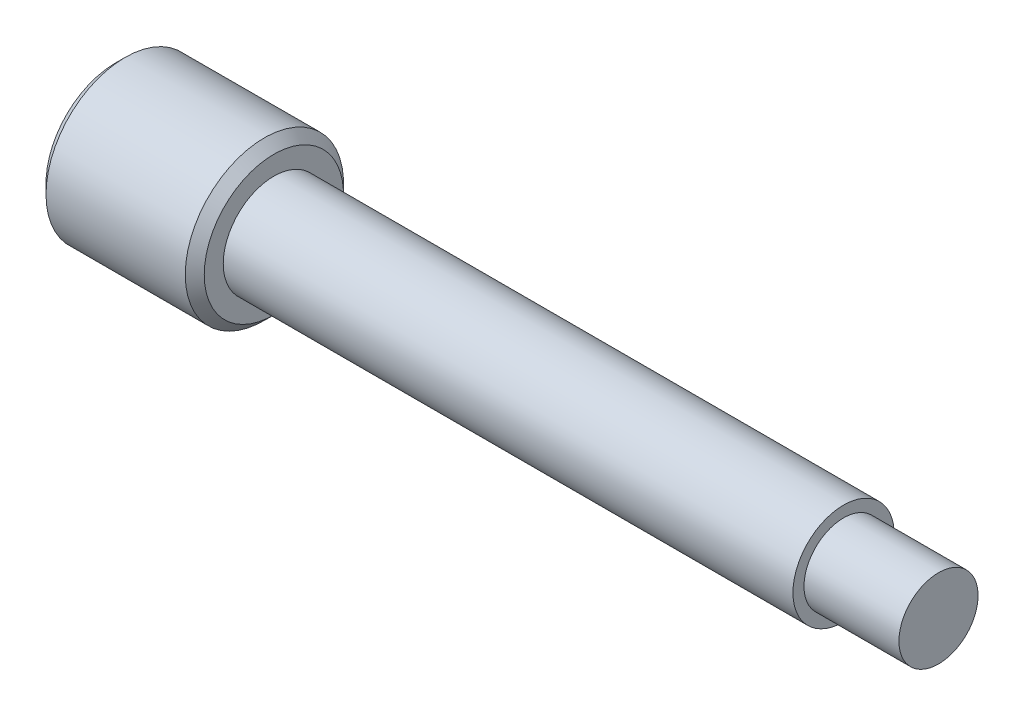
ISO-10303-21;
HEADER;
FILE_DESCRIPTION(('STEP AP214'),'2;1');
FILE_NAME('part.step','',(''),(''),'','','');
FILE_SCHEMA(('AUTOMOTIVE_DESIGN { 1 0 10303 214 1 1 1 1 }'));
ENDSEC;
DATA;
#1=APPLICATION_CONTEXT('core data for automotive mechanical design processes');
#2=APPLICATION_PROTOCOL_DEFINITION('international standard','automotive_design',2000,#1);
#3=PRODUCT_CONTEXT('',#1,'mechanical');
#4=PRODUCT('Part','Part','',(#3));
#5=PRODUCT_RELATED_PRODUCT_CATEGORY('part','',(#4));
#6=PRODUCT_DEFINITION_FORMATION('','',#4);
#7=PRODUCT_DEFINITION_CONTEXT('part definition',#1,'design');
#8=PRODUCT_DEFINITION('design','',#6,#7);
#9=PRODUCT_DEFINITION_SHAPE('','',#8);
#10=(LENGTH_UNIT() NAMED_UNIT(*) SI_UNIT(.MILLI.,.METRE.));
#11=(NAMED_UNIT(*) PLANE_ANGLE_UNIT() SI_UNIT($,.RADIAN.));
#12=(NAMED_UNIT(*) SI_UNIT($,.STERADIAN.) SOLID_ANGLE_UNIT());
#13=UNCERTAINTY_MEASURE_WITH_UNIT(LENGTH_MEASURE(1.E-05),#10,'distance_accuracy_value','');
#14=(GEOMETRIC_REPRESENTATION_CONTEXT(3) GLOBAL_UNCERTAINTY_ASSIGNED_CONTEXT((#13)) GLOBAL_UNIT_ASSIGNED_CONTEXT((#10,
#11,#12)) REPRESENTATION_CONTEXT('',''));
#15=CARTESIAN_POINT('',(0.,0.,0.));
#16=DIRECTION('',(0.,0.,1.));
#17=DIRECTION('',(1.,0.,0.));
#18=AXIS2_PLACEMENT_3D('',#15,#16,#17);
#19=CARTESIAN_POINT('',(-16.4965034965035,0.,0.));
#20=DIRECTION('',(1.,0.,0.));
#21=DIRECTION('',(0.,0.,-1.));
#22=AXIS2_PLACEMENT_3D('',#19,#20,#21);
#23=PLANE('',#22);
#24=CARTESIAN_POINT('',(-16.4965034965035,0.,0.));
#25=DIRECTION('',(1.,0.,0.));
#26=DIRECTION('',(0.,0.,-1.));
#27=AXIS2_PLACEMENT_3D('',#24,#25,#26);
#28=CIRCLE('',#27,2.19999999999999);
#29=CARTESIAN_POINT('',(-16.4965034965035,0.,-2.19999999999999));
#30=VERTEX_POINT('',#29);
#31=EDGE_CURVE('E12',#30,#30,#28,.F.);
#32=ORIENTED_EDGE('',*,*,#31,.T.);
#33=EDGE_LOOP('',(#32));
#34=FACE_BOUND('',#33,.T.);
#35=ADVANCED_FACE('F44',(#34),#23,.F.);
#36=CARTESIAN_POINT('',(-6.15384615384615,0.,0.));
#37=DIRECTION('',(-1.,0.,0.));
#38=DIRECTION('',(0.,0.,1.));
#39=AXIS2_PLACEMENT_3D('',#36,#37,#38);
#40=CYLINDRICAL_SURFACE('',#39,2.5);
#41=CARTESIAN_POINT('',(-11.7965034965035,0.,0.));
#42=DIRECTION('',(-1.,0.,0.));
#43=DIRECTION('',(0.,0.,1.));
#44=AXIS2_PLACEMENT_3D('',#41,#42,#43);
#45=CIRCLE('',#44,2.5);
#46=CARTESIAN_POINT('',(-11.7965034965035,0.,2.5));
#47=VERTEX_POINT('',#46);
#48=EDGE_CURVE('E55',#47,#47,#45,.T.);
#49=ORIENTED_EDGE('',*,*,#48,.T.);
#50=EDGE_LOOP('',(#49));
#51=FACE_BOUND('',#50,.T.);
#52=CARTESIAN_POINT('',(-16.1965034965035,0.,0.));
#53=DIRECTION('',(1.,0.,0.));
#54=DIRECTION('',(0.,0.,-1.));
#55=AXIS2_PLACEMENT_3D('',#52,#53,#54);
#56=CIRCLE('',#55,2.5);
#57=CARTESIAN_POINT('',(-16.1965034965035,0.,-2.5));
#58=VERTEX_POINT('',#57);
#59=EDGE_CURVE('E59',#58,#58,#56,.T.);
#60=ORIENTED_EDGE('',*,*,#59,.T.);
#61=EDGE_LOOP('',(#60));
#62=FACE_BOUND('',#61,.T.);
#63=ADVANCED_FACE('F92',(#51,#62),#40,.T.);
#64=CARTESIAN_POINT('',(-11.4965034965035,0.,-2.5));
#65=DIRECTION('',(-1.,0.,0.));
#66=DIRECTION('',(0.,0.,1.));
#67=AXIS2_PLACEMENT_3D('',#64,#65,#66);
#68=PLANE('',#67);
#69=CARTESIAN_POINT('',(-11.4965034965035,0.,0.));
#70=DIRECTION('',(-1.,0.,0.));
#71=DIRECTION('',(0.,0.,1.));
#72=AXIS2_PLACEMENT_3D('',#69,#70,#71);
#73=CIRCLE('',#72,2.19999999999999);
#74=CARTESIAN_POINT('',(-11.4965034965035,0.,2.19999999999999));
#75=VERTEX_POINT('',#74);
#76=EDGE_CURVE('E51',#75,#75,#73,.F.);
#77=ORIENTED_EDGE('',*,*,#76,.T.);
#78=EDGE_LOOP('',(#77));
#79=FACE_BOUND('',#78,.T.);
#80=CARTESIAN_POINT('',(-11.4965034965035,0.,0.));
#81=DIRECTION('',(-1.,0.,0.));
#82=DIRECTION('',(0.,0.,1.));
#83=AXIS2_PLACEMENT_3D('',#80,#81,#82);
#84=CIRCLE('',#83,1.6);
#85=CARTESIAN_POINT('',(-11.4965034965035,0.,1.6));
#86=VERTEX_POINT('',#85);
#87=EDGE_CURVE('E64',#86,#86,#84,.T.);
#88=ORIENTED_EDGE('',*,*,#87,.T.);
#89=EDGE_LOOP('',(#88));
#90=FACE_BOUND('',#89,.T.);
#91=ADVANCED_FACE('F97',(#79,#90),#68,.F.);
#92=CARTESIAN_POINT('',(-6.15384615384615,0.,0.));
#93=DIRECTION('',(-1.,0.,0.));
#94=DIRECTION('',(0.,0.,1.));
#95=AXIS2_PLACEMENT_3D('',#92,#93,#94);
#96=CYLINDRICAL_SURFACE('',#95,1.6);
#97=ORIENTED_EDGE('',*,*,#87,.F.);
#98=EDGE_LOOP('',(#97));
#99=FACE_BOUND('',#98,.T.);
#100=CARTESIAN_POINT('',(6.5034965034965,0.,0.));
#101=DIRECTION('',(-1.,0.,0.));
#102=DIRECTION('',(0.,0.,1.));
#103=AXIS2_PLACEMENT_3D('',#100,#101,#102);
#104=CIRCLE('',#103,1.6);
#105=CARTESIAN_POINT('',(6.5034965034965,0.,1.6));
#106=VERTEX_POINT('',#105);
#107=EDGE_CURVE('E67',#106,#106,#104,.T.);
#108=ORIENTED_EDGE('',*,*,#107,.T.);
#109=EDGE_LOOP('',(#108));
#110=FACE_BOUND('',#109,.T.);
#111=ADVANCED_FACE('F103',(#99,#110),#96,.T.);
#112=CARTESIAN_POINT('',(6.5034965034965,0.,-1.6));
#113=DIRECTION('',(-1.,0.,0.));
#114=DIRECTION('',(0.,0.,1.));
#115=AXIS2_PLACEMENT_3D('',#112,#113,#114);
#116=PLANE('',#115);
#117=ORIENTED_EDGE('',*,*,#107,.F.);
#118=EDGE_LOOP('',(#117));
#119=FACE_BOUND('',#118,.T.);
#120=CARTESIAN_POINT('',(6.5034965034965,0.,0.));
#121=DIRECTION('',(-1.,0.,0.));
#122=DIRECTION('',(0.,0.,1.));
#123=AXIS2_PLACEMENT_3D('',#120,#121,#122);
#124=CIRCLE('',#123,1.25);
#125=CARTESIAN_POINT('',(6.5034965034965,0.,1.25));
#126=VERTEX_POINT('',#125);
#127=EDGE_CURVE('E70',#126,#126,#124,.T.);
#128=ORIENTED_EDGE('',*,*,#127,.T.);
#129=EDGE_LOOP('',(#128));
#130=FACE_BOUND('',#129,.T.);
#131=ADVANCED_FACE('F88',(#119,#130),#116,.F.);
#132=CARTESIAN_POINT('',(-6.15384615384615,0.,0.));
#133=DIRECTION('',(-1.,0.,0.));
#134=DIRECTION('',(0.,0.,1.));
#135=AXIS2_PLACEMENT_3D('',#132,#133,#134);
#136=CYLINDRICAL_SURFACE('',#135,1.25);
#137=ORIENTED_EDGE('',*,*,#127,.F.);
#138=EDGE_LOOP('',(#137));
#139=FACE_BOUND('',#138,.T.);
#140=CARTESIAN_POINT('',(9.5034965034965,0.,0.));
#141=DIRECTION('',(-1.,0.,0.));
#142=DIRECTION('',(0.,0.,1.));
#143=AXIS2_PLACEMENT_3D('',#140,#141,#142);
#144=CIRCLE('',#143,1.25);
#145=CARTESIAN_POINT('',(9.5034965034965,0.,1.25));
#146=VERTEX_POINT('',#145);
#147=EDGE_CURVE('E73',#146,#146,#144,.T.);
#148=ORIENTED_EDGE('',*,*,#147,.T.);
#149=EDGE_LOOP('',(#148));
#150=FACE_BOUND('',#149,.T.);
#151=ADVANCED_FACE('F77',(#139,#150),#136,.T.);
#152=CARTESIAN_POINT('',(9.5034965034965,0.,-1.25));
#153=DIRECTION('',(-1.,0.,0.));
#154=DIRECTION('',(0.,0.,1.));
#155=AXIS2_PLACEMENT_3D('',#152,#153,#154);
#156=PLANE('',#155);
#157=ORIENTED_EDGE('',*,*,#147,.F.);
#158=EDGE_LOOP('',(#157));
#159=FACE_BOUND('',#158,.T.);
#160=ADVANCED_FACE('F79',(#159),#156,.F.);
#161=CARTESIAN_POINT('',(-11.7965034965035,0.,0.));
#162=DIRECTION('',(-1.,0.,0.));
#163=DIRECTION('',(0.,0.,1.));
#164=AXIS2_PLACEMENT_3D('',#161,#162,#163);
#165=CONICAL_SURFACE('',#164,2.5,0.785398163397453);
#166=ORIENTED_EDGE('',*,*,#76,.F.);
#167=EDGE_LOOP('',(#166));
#168=FACE_BOUND('',#167,.T.);
#169=ORIENTED_EDGE('',*,*,#48,.F.);
#170=EDGE_LOOP('',(#169));
#171=FACE_BOUND('',#170,.T.);
#172=ADVANCED_FACE('F81',(#168,#171),#165,.T.);
#173=CARTESIAN_POINT('',(-16.4965034965035,0.,0.));
#174=DIRECTION('',(1.,0.,0.));
#175=DIRECTION('',(0.,0.,-1.));
#176=AXIS2_PLACEMENT_3D('',#173,#174,#175);
#177=CONICAL_SURFACE('',#176,2.19999999999999,0.785398163397453);
#178=ORIENTED_EDGE('',*,*,#59,.F.);
#179=EDGE_LOOP('',(#178));
#180=FACE_BOUND('',#179,.T.);
#181=ORIENTED_EDGE('',*,*,#31,.F.);
#182=EDGE_LOOP('',(#181));
#183=FACE_BOUND('',#182,.T.);
#184=ADVANCED_FACE('F46',(#180,#183),#177,.T.);
#185=CLOSED_SHELL('',(#35,#63,#91,#111,#131,#151,#160,#172,#184));
#186=MANIFOLD_SOLID_BREP('B2',#185);
#187=ADVANCED_BREP_SHAPE_REPRESENTATION('',(#18,#186),#14);
#188=SHAPE_DEFINITION_REPRESENTATION(#9,#187);
ENDSEC;
END-ISO-10303-21;
